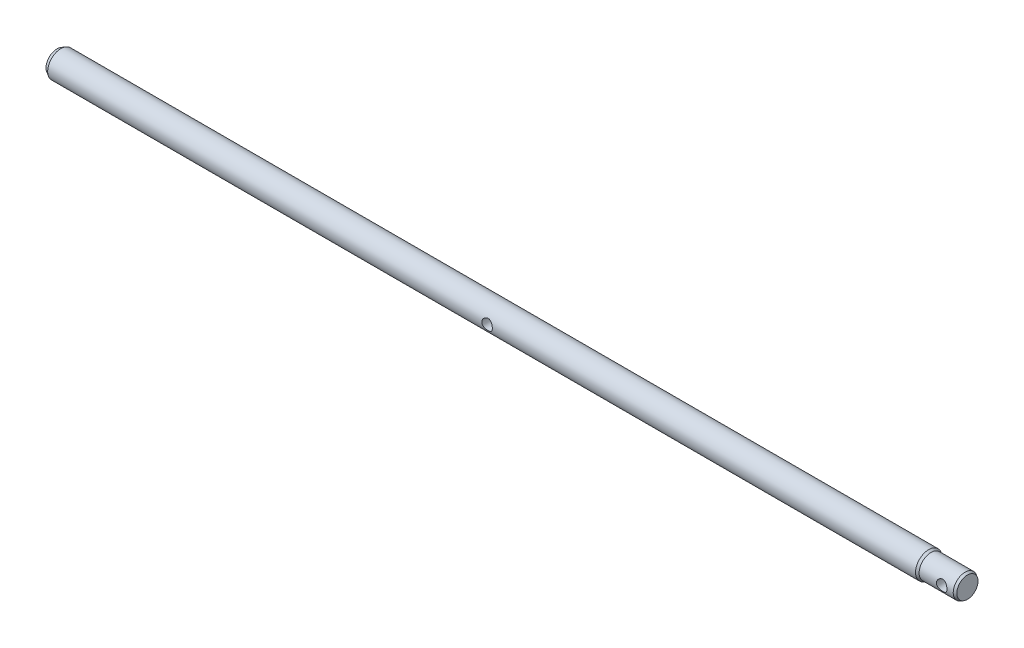
ISO-10303-21;
HEADER;
FILE_DESCRIPTION(('STEP AP214'),'2;1');
FILE_NAME('part.step','',(''),(''),'','','');
FILE_SCHEMA(('AUTOMOTIVE_DESIGN { 1 0 10303 214 1 1 1 1 }'));
ENDSEC;
DATA;
#1=APPLICATION_CONTEXT('core data for automotive mechanical design processes');
#2=APPLICATION_PROTOCOL_DEFINITION('international standard','automotive_design',2000,#1);
#3=PRODUCT_CONTEXT('',#1,'mechanical');
#4=PRODUCT('Part','Part','',(#3));
#5=PRODUCT_RELATED_PRODUCT_CATEGORY('part','',(#4));
#6=PRODUCT_DEFINITION_FORMATION('','',#4);
#7=PRODUCT_DEFINITION_CONTEXT('part definition',#1,'design');
#8=PRODUCT_DEFINITION('design','',#6,#7);
#9=PRODUCT_DEFINITION_SHAPE('','',#8);
#10=(LENGTH_UNIT() NAMED_UNIT(*) SI_UNIT(.MILLI.,.METRE.));
#11=(NAMED_UNIT(*) PLANE_ANGLE_UNIT() SI_UNIT($,.RADIAN.));
#12=(NAMED_UNIT(*) SI_UNIT($,.STERADIAN.) SOLID_ANGLE_UNIT());
#13=UNCERTAINTY_MEASURE_WITH_UNIT(LENGTH_MEASURE(1.E-05),#10,'distance_accuracy_value','');
#14=(GEOMETRIC_REPRESENTATION_CONTEXT(3) GLOBAL_UNCERTAINTY_ASSIGNED_CONTEXT((#13)) GLOBAL_UNIT_ASSIGNED_CONTEXT((#10,
#11,#12)) REPRESENTATION_CONTEXT('',''));
#15=CARTESIAN_POINT('',(0.,0.,0.));
#16=DIRECTION('',(0.,0.,1.));
#17=DIRECTION('',(1.,0.,0.));
#18=AXIS2_PLACEMENT_3D('',#15,#16,#17);
#19=CARTESIAN_POINT('',(-142.,0.,0.));
#20=DIRECTION('',(-1.,0.,0.));
#21=DIRECTION('',(0.,0.,1.));
#22=AXIS2_PLACEMENT_3D('',#19,#20,#21);
#23=PLANE('',#22);
#24=CARTESIAN_POINT('',(-142.,0.,0.));
#25=DIRECTION('',(-1.,0.,0.));
#26=DIRECTION('',(0.,0.,1.));
#27=AXIS2_PLACEMENT_3D('',#24,#25,#26);
#28=CIRCLE('',#27,8.26794919243105);
#29=CARTESIAN_POINT('',(-142.,0.,8.26794919243105));
#30=VERTEX_POINT('',#29);
#31=EDGE_CURVE('E43',#30,#30,#28,.T.);
#32=ORIENTED_EDGE('',*,*,#31,.T.);
#33=EDGE_LOOP('',(#32));
#34=FACE_BOUND('',#33,.T.);
#35=ADVANCED_FACE('F33',(#34),#23,.T.);
#36=CARTESIAN_POINT('',(-98.,0.,0.));
#37=DIRECTION('',(-1.,0.,0.));
#38=DIRECTION('',(0.,0.,1.));
#39=AXIS2_PLACEMENT_3D('',#36,#37,#38);
#40=CYLINDRICAL_SURFACE('',#39,9.99999999999996);
#41=CARTESIAN_POINT('',(197.,0.,9.99999999999996));
#42=CARTESIAN_POINT('',(196.999998425067,0.107549581345533,9.9999988687126));
#43=CARTESIAN_POINT('',(196.99565632892,0.215132147940354,9.99825999367795));
#44=CARTESIAN_POINT('',(196.978326617216,0.429535200549536,9.99134740691104));
#45=CARTESIAN_POINT('',(196.965333546597,0.536355162703287,9.98617152790584));
#46=CARTESIAN_POINT('',(196.930791965449,0.748635856497401,9.97250573560114));
#47=CARTESIAN_POINT('',(196.90922494538,0.854093134440854,9.96400865312139));
#48=CARTESIAN_POINT('',(196.857758269563,1.06266761114008,9.9439301721157));
#49=CARTESIAN_POINT('',(196.827855233745,1.16578384227259,9.93234752254495));
#50=CARTESIAN_POINT('',(196.726277191284,1.46979509681069,9.893491121622));
#51=CARTESIAN_POINT('',(196.642578180994,1.66629107461993,9.8620445884613));
#52=CARTESIAN_POINT('',(196.44595378265,2.04217417878103,9.79113035538704));
#53=CARTESIAN_POINT('',(196.333038539885,2.22156721456799,9.75166544086258));
#54=CARTESIAN_POINT('',(196.075531245478,2.56699339938209,9.66661825353087));
#55=CARTESIAN_POINT('',(195.929787289424,2.73212223266509,9.62084608086595));
#56=CARTESIAN_POINT('',(195.613199390848,3.03635232313264,9.52921139577227));
#57=CARTESIAN_POINT('',(195.442343240983,3.17544084661153,9.48334885017042));
#58=CARTESIAN_POINT('',(195.071144031434,3.42974847409894,9.39445587657954));
#59=CARTESIAN_POINT('',(194.869827073936,3.54362978572888,9.35164233015929));
#60=CARTESIAN_POINT('',(194.448927157199,3.73550961465234,9.27667293288066));
#61=CARTESIAN_POINT('',(194.229352932259,3.81352517485722,9.24451202207141));
#62=CARTESIAN_POINT('',(193.788575344314,3.92779760260541,9.19652715590085));
#63=CARTESIAN_POINT('',(193.567897531912,3.96578791979825,9.1800284077138));
#64=CARTESIAN_POINT('',(193.122730000323,4.00434593508727,9.16328008038138));
#65=CARTESIAN_POINT('',(192.898242209989,4.00493203570085,9.16302251073198));
#66=CARTESIAN_POINT('',(192.468486657777,3.96997873214739,9.17821000534297));
#67=CARTESIAN_POINT('',(192.262968571234,3.93695062778271,9.19256349925662));
#68=CARTESIAN_POINT('',(191.86068088765,3.83989376129507,9.23352375055549));
#69=CARTESIAN_POINT('',(191.663912823694,3.77585958980133,9.26013264599917));
#70=CARTESIAN_POINT('',(191.279964327708,3.61738946491139,9.32318970221157));
#71=CARTESIAN_POINT('',(191.093061521918,3.52235972457939,9.35982758573419));
#72=CARTESIAN_POINT('',(190.73716836725,3.30501292151569,9.43876232767922));
#73=CARTESIAN_POINT('',(190.568184781187,3.1826856102159,9.48106130910407));
#74=CARTESIAN_POINT('',(190.239180542404,2.90310119889356,9.57053473488077));
#75=CARTESIAN_POINT('',(190.08086254111,2.74387492593716,9.61783329953248));
#76=CARTESIAN_POINT('',(189.792631043994,2.40062885486448,9.70919649915611));
#77=CARTESIAN_POINT('',(189.662723205179,2.21660413066996,9.75326048890389));
#78=CARTESIAN_POINT('',(189.432765105169,1.82415530521053,9.83429362529355));
#79=CARTESIAN_POINT('',(189.333355437606,1.61532098269263,9.87110540190895));
#80=CARTESIAN_POINT('',(189.171664277844,1.18204753096604,9.93229656657443));
#81=CARTESIAN_POINT('',(189.109363924885,0.957616393699384,9.95668226924741));
#82=CARTESIAN_POINT('',(189.027103409161,0.513791775215582,9.98912279013834));
#83=CARTESIAN_POINT('',(189.004855091493,0.294886587971133,9.9980589166703));
#84=CARTESIAN_POINT('',(188.996573798943,-0.143690619615711,10.0013695702125));
#85=CARTESIAN_POINT('',(189.010531436905,-0.363362426448185,9.99574787164573));
#86=CARTESIAN_POINT('',(189.072583505104,-0.786865478243657,9.97115134127507));
#87=CARTESIAN_POINT('',(189.119115960703,-0.990964983549767,9.95278782691059));
#88=CARTESIAN_POINT('',(189.242871416619,-1.38827085612275,9.90518882810979));
#89=CARTESIAN_POINT('',(189.320098359335,-1.58147582045412,9.87595194712995));
#90=CARTESIAN_POINT('',(189.505569879362,-1.95815757162884,9.80833189541682));
#91=CARTESIAN_POINT('',(189.614690944095,-2.14115604549353,9.76969631959843));
#92=CARTESIAN_POINT('',(189.859880647803,-2.4868871825104,9.68746729490804));
#93=CARTESIAN_POINT('',(189.995960085814,-2.64961168158685,9.64387186219638));
#94=CARTESIAN_POINT('',(190.301740025933,-2.96144608598878,9.55290235277177));
#95=CARTESIAN_POINT('',(190.473067083141,-3.10894786734725,9.50546882853783));
#96=CARTESIAN_POINT('',(190.83888016589,-3.37350239509233,9.41483345830576));
#97=CARTESIAN_POINT('',(191.033370000199,-3.4905501236659,9.37163231039238));
#98=CARTESIAN_POINT('',(191.442923389673,-3.69161500286276,9.29428599829326));
#99=CARTESIAN_POINT('',(191.658168000243,-3.77530118531765,9.26023261821736));
#100=CARTESIAN_POINT('',(192.101467301613,-3.90459244315907,9.20647346903732));
#101=CARTESIAN_POINT('',(192.329512404842,-3.95022562452796,9.18675711197456));
#102=CARTESIAN_POINT('',(192.774255809844,-3.99943122157416,9.16543518780385));
#103=CARTESIAN_POINT('',(192.990589701895,-4.00579411777209,9.16262842667608));
#104=CARTESIAN_POINT('',(193.421089692721,-3.98360636538273,9.17229671415005));
#105=CARTESIAN_POINT('',(193.635256063282,-3.95506015014709,9.18476982225492));
#106=CARTESIAN_POINT('',(194.04666446089,-3.86614256488128,9.22253300486266));
#107=CARTESIAN_POINT('',(194.244240846221,-3.80707437387706,9.24729672182965));
#108=CARTESIAN_POINT('',(194.62675696179,-3.66001151041637,9.30647993934961));
#109=CARTESIAN_POINT('',(194.811693185111,-3.5720088493455,9.340902106151));
#110=CARTESIAN_POINT('',(195.175220410709,-3.36374310804133,9.41797252826466));
#111=CARTESIAN_POINT('',(195.352841830688,-3.24192140926544,9.46097893410832));
#112=CARTESIAN_POINT('',(195.685982142625,-2.97179350239177,9.54927479921247));
#113=CARTESIAN_POINT('',(195.84149434729,-2.82347931168581,9.59456494363936));
#114=CARTESIAN_POINT('',(196.136423592531,-2.49297412446699,9.6858764714096));
#115=CARTESIAN_POINT('',(196.274143383982,-2.30921017071955,9.73175488236388));
#116=CARTESIAN_POINT('',(196.456048108938,-2.01716584575532,9.79495027625766));
#117=CARTESIAN_POINT('',(196.512607063853,-1.91699501972423,9.81509269692651));
#118=CARTESIAN_POINT('',(196.617037995405,-1.71180110982479,9.85294835133015));
#119=CARTESIAN_POINT('',(196.664913949808,-1.60678027559742,9.87066269647661));
#120=CARTESIAN_POINT('',(196.750747984685,-1.39454646904328,9.90285599354906));
#121=CARTESIAN_POINT('',(196.788870154747,-1.28740777135872,9.91738778532473));
#122=CARTESIAN_POINT('',(196.855921347721,-1.06995577523384,9.94319722915709));
#123=CARTESIAN_POINT('',(196.88485465735,-0.959643983352626,9.95447639837578));
#124=CARTESIAN_POINT('',(196.933174836149,-0.736945215856847,9.97343330649394));
#125=CARTESIAN_POINT('',(196.952585911645,-0.624564263591293,9.98112017494331));
#126=CARTESIAN_POINT('',(196.981738570666,-0.398419132407614,9.99270031578289));
#127=CARTESIAN_POINT('',(196.991487026834,-0.284655994966361,9.99659628445546));
#128=CARTESIAN_POINT('',(196.998785895573,-0.113830463425496,9.99951445883953));
#129=CARTESIAN_POINT('',(197.000000833522,-0.0569198512645321,10.0000005987257));
#130=CARTESIAN_POINT('',(197.,0.,9.99999999999996));
#131=B_SPLINE_CURVE_WITH_KNOTS('',3,(#41,#42,#43,#44,#45,#46,#47,#48,#49,#50,#51,#52,#53,#54,
#55,#56,#57,#58,#59,#60,#61,#62,#63,#64,#65,#66,#67,#68,#69,#70,#71,#72,#73,#74,#75,#76,#77,#78,
#79,#80,#81,#82,#83,#84,#85,#86,#87,#88,#89,#90,#91,#92,#93,#94,#95,#96,#97,#98,#99,#100,#101,
#102,#103,#104,#105,#106,#107,#108,#109,#110,#111,#112,#113,#114,#115,#116,#117,#118,#119,#120,
#121,#122,#123,#124,#125,#126,#127,#128,#129,#130),.UNSPECIFIED.,.T.,.F.,(4,2,2,2,2,2,2,2,2,2,2,
2,2,2,2,2,2,2,2,2,2,2,2,2,2,2,2,2,2,2,2,2,2,2,2,2,2,2,2,2,2,2,2,2,4),(0.,0.322603993422146,
0.645411604786468,0.968919914471222,1.29255959093094,1.93701523385825,2.58124739027476,
3.25313995292302,3.92536021760332,4.62749749529943,5.32930078128044,5.99927442509165,
6.66891844572484,7.29195888698823,7.91510806412267,8.55097484497804,9.18708075776539,
9.87235930273286,10.5577741757964,11.2567305822579,11.9553314412775,12.6125760095619,
13.2696501904034,13.897201430289,14.5248332988777,15.171662586967,15.8187515089811,
16.50856181149,17.1984856998767,17.8950932218182,18.5911857719204,19.2371857868567,
19.8831037702626,20.5034786899771,21.1240250351049,21.7801016801355,22.4363763459696,
23.1352007896784,23.4851924266231,23.8350233218042,24.1785111324565,24.5218384656199,
24.864288449595,25.2064946871485,25.3772305569976),.UNSPECIFIED.);
#132=CARTESIAN_POINT('',(197.,0.,9.99999999999996));
#133=VERTEX_POINT('',#132);
#134=EDGE_CURVE('E36',#133,#133,#131,.T.);
#135=ORIENTED_EDGE('',*,*,#134,.F.);
#136=EDGE_LOOP('',(#135));
#137=FACE_BOUND('',#136,.T.);
#138=CARTESIAN_POINT('',(197.,0.,-9.99999999999996));
#139=CARTESIAN_POINT('',(196.999998425067,-0.107549581345535,-9.9999988687126));
#140=CARTESIAN_POINT('',(196.99565632892,-0.215132147940358,-9.99825999367795));
#141=CARTESIAN_POINT('',(196.978326617216,-0.429535200549543,-9.99134740691104));
#142=CARTESIAN_POINT('',(196.965333546597,-0.536355162703295,-9.98617152790584));
#143=CARTESIAN_POINT('',(196.930791965449,-0.748635856497411,-9.97250573560114));
#144=CARTESIAN_POINT('',(196.90922494538,-0.854093134440865,-9.96400865312139));
#145=CARTESIAN_POINT('',(196.857758269563,-1.06266761114009,-9.9439301721157));
#146=CARTESIAN_POINT('',(196.827855233745,-1.16578384227259,-9.93234752254495));
#147=CARTESIAN_POINT('',(196.726277191284,-1.46979509681069,-9.893491121622));
#148=CARTESIAN_POINT('',(196.642578180994,-1.66629107461993,-9.8620445884613));
#149=CARTESIAN_POINT('',(196.44595378265,-2.04217417878102,-9.79113035538704));
#150=CARTESIAN_POINT('',(196.333038539885,-2.22156721456799,-9.75166544086258));
#151=CARTESIAN_POINT('',(196.075531245478,-2.56699339938209,-9.66661825353087));
#152=CARTESIAN_POINT('',(195.929787289424,-2.73212223266509,-9.62084608086595));
#153=CARTESIAN_POINT('',(195.613199390848,-3.03635232313264,-9.52921139577227));
#154=CARTESIAN_POINT('',(195.442343240983,-3.17544084661153,-9.48334885017042));
#155=CARTESIAN_POINT('',(195.071144031434,-3.42974847409894,-9.39445587657954));
#156=CARTESIAN_POINT('',(194.869827073936,-3.54362978572888,-9.3516423301593));
#157=CARTESIAN_POINT('',(194.448927157199,-3.73550961465234,-9.27667293288066));
#158=CARTESIAN_POINT('',(194.229352932259,-3.81352517485722,-9.24451202207141));
#159=CARTESIAN_POINT('',(193.788575344314,-3.92779760260541,-9.19652715590085));
#160=CARTESIAN_POINT('',(193.567897531912,-3.96578791979825,-9.1800284077138));
#161=CARTESIAN_POINT('',(193.122730000323,-4.00434593508727,-9.16328008038138));
#162=CARTESIAN_POINT('',(192.898242209989,-4.00493203570085,-9.16302251073198));
#163=CARTESIAN_POINT('',(192.468486657777,-3.96997873214739,-9.17821000534297));
#164=CARTESIAN_POINT('',(192.262968571234,-3.93695062778271,-9.19256349925662));
#165=CARTESIAN_POINT('',(191.86068088765,-3.83989376129507,-9.23352375055549));
#166=CARTESIAN_POINT('',(191.663912823694,-3.77585958980133,-9.26013264599917));
#167=CARTESIAN_POINT('',(191.279964327708,-3.61738946491139,-9.32318970221157));
#168=CARTESIAN_POINT('',(191.093061521918,-3.52235972457939,-9.35982758573419));
#169=CARTESIAN_POINT('',(190.73716836725,-3.30501292151569,-9.43876232767922));
#170=CARTESIAN_POINT('',(190.568184781187,-3.1826856102159,-9.48106130910407));
#171=CARTESIAN_POINT('',(190.239180542404,-2.90310119889356,-9.57053473488077));
#172=CARTESIAN_POINT('',(190.08086254111,-2.74387492593716,-9.61783329953248));
#173=CARTESIAN_POINT('',(189.792631043994,-2.40062885486448,-9.70919649915611));
#174=CARTESIAN_POINT('',(189.662723205179,-2.21660413066996,-9.75326048890389));
#175=CARTESIAN_POINT('',(189.432765105169,-1.82415530521053,-9.83429362529355));
#176=CARTESIAN_POINT('',(189.333355437606,-1.61532098269263,-9.87110540190895));
#177=CARTESIAN_POINT('',(189.171664277844,-1.18204753096604,-9.93229656657443));
#178=CARTESIAN_POINT('',(189.109363924885,-0.957616393699384,-9.95668226924741));
#179=CARTESIAN_POINT('',(189.027103409161,-0.513791775215582,-9.98912279013834));
#180=CARTESIAN_POINT('',(189.004855091493,-0.294886587971133,-9.9980589166703));
#181=CARTESIAN_POINT('',(188.996573798943,0.143690619615711,-10.0013695702125));
#182=CARTESIAN_POINT('',(189.010531436905,0.363362426448185,-9.99574787164573));
#183=CARTESIAN_POINT('',(189.072583505104,0.786865478243657,-9.97115134127507));
#184=CARTESIAN_POINT('',(189.119115960703,0.990964983549767,-9.95278782691059));
#185=CARTESIAN_POINT('',(189.242871416619,1.38827085612275,-9.90518882810979));
#186=CARTESIAN_POINT('',(189.320098359335,1.58147582045412,-9.87595194712995));
#187=CARTESIAN_POINT('',(189.505569879362,1.95815757162884,-9.80833189541682));
#188=CARTESIAN_POINT('',(189.614690944095,2.14115604549353,-9.76969631959843));
#189=CARTESIAN_POINT('',(189.859880647803,2.4868871825104,-9.68746729490804));
#190=CARTESIAN_POINT('',(189.995960085814,2.64961168158685,-9.64387186219638));
#191=CARTESIAN_POINT('',(190.301740025933,2.96144608598878,-9.55290235277177));
#192=CARTESIAN_POINT('',(190.473067083141,3.10894786734724,-9.50546882853783));
#193=CARTESIAN_POINT('',(190.83888016589,3.37350239509233,-9.41483345830576));
#194=CARTESIAN_POINT('',(191.033370000199,3.49055012366589,-9.37163231039238));
#195=CARTESIAN_POINT('',(191.442923389673,3.69161500286276,-9.29428599829326));
#196=CARTESIAN_POINT('',(191.658168000243,3.77530118531765,-9.26023261821736));
#197=CARTESIAN_POINT('',(192.101467301613,3.90459244315907,-9.20647346903732));
#198=CARTESIAN_POINT('',(192.329512404842,3.95022562452796,-9.18675711197456));
#199=CARTESIAN_POINT('',(192.774255809844,3.99943122157416,-9.16543518780385));
#200=CARTESIAN_POINT('',(192.990589701895,4.00579411777209,-9.16262842667608));
#201=CARTESIAN_POINT('',(193.421089692721,3.98360636538273,-9.17229671415005));
#202=CARTESIAN_POINT('',(193.635256063282,3.95506015014709,-9.18476982225492));
#203=CARTESIAN_POINT('',(194.04666446089,3.86614256488128,-9.22253300486266));
#204=CARTESIAN_POINT('',(194.244240846221,3.80707437387706,-9.24729672182965));
#205=CARTESIAN_POINT('',(194.62675696179,3.66001151041637,-9.30647993934961));
#206=CARTESIAN_POINT('',(194.811693185111,3.5720088493455,-9.340902106151));
#207=CARTESIAN_POINT('',(195.175220410709,3.36374310804133,-9.41797252826466));
#208=CARTESIAN_POINT('',(195.352841830688,3.24192140926544,-9.46097893410832));
#209=CARTESIAN_POINT('',(195.685982142625,2.97179350239177,-9.54927479921247));
#210=CARTESIAN_POINT('',(195.84149434729,2.82347931168581,-9.59456494363936));
#211=CARTESIAN_POINT('',(196.136423592531,2.49297412446699,-9.6858764714096));
#212=CARTESIAN_POINT('',(196.274143383982,2.30921017071955,-9.73175488236389));
#213=CARTESIAN_POINT('',(196.456048108938,2.01716584575533,-9.79495027625766));
#214=CARTESIAN_POINT('',(196.512607063853,1.91699501972425,-9.81509269692651));
#215=CARTESIAN_POINT('',(196.617037995405,1.7118011098248,-9.85294835133015));
#216=CARTESIAN_POINT('',(196.664913949808,1.60678027559742,-9.87066269647661));
#217=CARTESIAN_POINT('',(196.750747984685,1.39454646904328,-9.90285599354906));
#218=CARTESIAN_POINT('',(196.788870154747,1.28740777135872,-9.91738778532473));
#219=CARTESIAN_POINT('',(196.855921347721,1.06995577523384,-9.94319722915709));
#220=CARTESIAN_POINT('',(196.88485465735,0.959643983352623,-9.95447639837578));
#221=CARTESIAN_POINT('',(196.933174836149,0.736945215856843,-9.97343330649394));
#222=CARTESIAN_POINT('',(196.952585911645,0.62456426359129,-9.98112017494331));
#223=CARTESIAN_POINT('',(196.981738570666,0.398419132407612,-9.99270031578289));
#224=CARTESIAN_POINT('',(196.991487026834,0.28465599496636,-9.99659628445546));
#225=CARTESIAN_POINT('',(196.998785895573,0.113830463425497,-9.99951445883953));
#226=CARTESIAN_POINT('',(197.000000833522,0.0569198512645322,-10.0000005987257));
#227=CARTESIAN_POINT('',(197.,0.,-9.99999999999996));
#228=B_SPLINE_CURVE_WITH_KNOTS('',3,(#138,#139,#140,#141,#142,#143,#144,#145,#146,#147,#148,
#149,#150,#151,#152,#153,#154,#155,#156,#157,#158,#159,#160,#161,#162,#163,#164,#165,#166,#167,
#168,#169,#170,#171,#172,#173,#174,#175,#176,#177,#178,#179,#180,#181,#182,#183,#184,#185,#186,
#187,#188,#189,#190,#191,#192,#193,#194,#195,#196,#197,#198,#199,#200,#201,#202,#203,#204,#205,
#206,#207,#208,#209,#210,#211,#212,#213,#214,#215,#216,#217,#218,#219,#220,#221,#222,#223,#224,
#225,#226,#227),.UNSPECIFIED.,.T.,.F.,(4,2,2,2,2,2,2,2,2,2,2,2,2,2,2,2,2,2,2,2,2,2,2,2,2,2,2,2,
2,2,2,2,2,2,2,2,2,2,2,2,2,2,2,2,4),(0.,0.322603993422152,0.645411604786476,0.968919914471232,
1.29255959093094,1.93701523385824,2.58124739027476,3.25313995292302,3.92536021760332,
4.62749749529943,5.32930078128044,5.99927442509165,6.66891844572484,7.29195888698823,
7.91510806412267,8.55097484497804,9.18708075776539,9.87235930273286,10.5577741757964,
11.2567305822579,11.9553314412775,12.6125760095619,13.2696501904034,13.897201430289,
14.5248332988777,15.171662586967,15.8187515089811,16.50856181149,17.1984856998767,
17.8950932218182,18.5911857719204,19.2371857868567,19.8831037702626,20.5034786899771,
21.1240250351049,21.7801016801355,22.4363763459696,23.1352007896784,23.4851924266231,
23.8350233218042,24.1785111324565,24.52183846562,24.864288449595,25.2064946871485,
25.3772305569976),.UNSPECIFIED.);
#229=CARTESIAN_POINT('',(197.,0.,-9.99999999999996));
#230=VERTEX_POINT('',#229);
#231=EDGE_CURVE('E107',#230,#230,#228,.T.);
#232=ORIENTED_EDGE('',*,*,#231,.F.);
#233=EDGE_LOOP('',(#232));
#234=FACE_BOUND('',#233,.T.);
#235=CARTESIAN_POINT('',(-139.,0.,0.));
#236=DIRECTION('',(-1.,0.,0.));
#237=DIRECTION('',(0.,0.,1.));
#238=AXIS2_PLACEMENT_3D('',#235,#236,#237);
#239=CIRCLE('',#238,9.99999999999996);
#240=CARTESIAN_POINT('',(-139.,0.,9.99999999999996));
#241=VERTEX_POINT('',#240);
#242=EDGE_CURVE('E10',#241,#241,#239,.F.);
#243=ORIENTED_EDGE('',*,*,#242,.T.);
#244=EDGE_LOOP('',(#243));
#245=FACE_BOUND('',#244,.T.);
#246=CARTESIAN_POINT('',(516.767949192431,0.,0.));
#247=DIRECTION('',(1.,0.,0.));
#248=DIRECTION('',(0.,0.,-1.));
#249=AXIS2_PLACEMENT_3D('',#246,#247,#248);
#250=CIRCLE('',#249,9.99999999999996);
#251=CARTESIAN_POINT('',(516.767949192431,0.,-9.99999999999996));
#252=VERTEX_POINT('',#251);
#253=EDGE_CURVE('E48',#252,#252,#250,.F.);
#254=ORIENTED_EDGE('',*,*,#253,.T.);
#255=EDGE_LOOP('',(#254));
#256=FACE_BOUND('',#255,.T.);
#257=ADVANCED_FACE('F90',(#137,#234,#245,#256),#40,.T.);
#258=CARTESIAN_POINT('',(-98.,0.,0.));
#259=DIRECTION('',(-1.,0.,0.));
#260=DIRECTION('',(0.,0.,1.));
#261=AXIS2_PLACEMENT_3D('',#258,#259,#260);
#262=CYLINDRICAL_SURFACE('',#261,9.);
#263=CARTESIAN_POINT('',(539.5,0.,9.));
#264=CARTESIAN_POINT('',(539.499999163301,0.106543560764117,8.99999931236002));
#265=CARTESIAN_POINT('',(539.495737372374,0.213114535933692,8.99810295733528));
#266=CARTESIAN_POINT('',(539.478733589349,0.425487759472882,8.99056534028924));
#267=CARTESIAN_POINT('',(539.465986753178,0.531289533809611,8.9849219391011));
#268=CARTESIAN_POINT('',(539.432115107433,0.741497571680322,8.97002203225641));
#269=CARTESIAN_POINT('',(539.410974631947,0.845900846236384,8.96075877099567));
#270=CARTESIAN_POINT('',(539.360547282036,1.05237393818871,8.93886560682324));
#271=CARTESIAN_POINT('',(539.331257077342,1.15444278316295,8.92623432770846));
#272=CARTESIAN_POINT('',(539.231826836376,1.45528706477072,8.88385509084484));
#273=CARTESIAN_POINT('',(539.149964533879,1.64969223818532,8.84954694128078));
#274=CARTESIAN_POINT('',(538.957842670196,2.02169397176,8.77205693690158));
#275=CARTESIAN_POINT('',(538.84758958203,2.19929435076139,8.72887710525827));
#276=CARTESIAN_POINT('',(538.595329590415,2.54295194306071,8.63520005099135));
#277=CARTESIAN_POINT('',(538.451994251306,2.70796463469608,8.58444255570289));
#278=CARTESIAN_POINT('',(538.140513942142,3.01251193717394,8.48237167141421));
#279=CARTESIAN_POINT('',(537.972354290521,3.15203136079605,8.43105797021838));
#280=CARTESIAN_POINT('',(537.60407902268,3.40970641309575,8.33031613694452));
#281=CARTESIAN_POINT('',(537.402678923526,3.5261634282701,8.28116793674047));
#282=CARTESIAN_POINT('',(537.08644164882,3.67379855799918,8.21620901778823));
#283=CARTESIAN_POINT('',(536.978630422092,3.7185134302312,8.19601074422209));
#284=CARTESIAN_POINT('',(536.758980884334,3.79849956446535,8.15924882688403));
#285=CARTESIAN_POINT('',(536.647144776258,3.83377590592704,8.14268322901323));
#286=CARTESIAN_POINT('',(536.426209995224,3.89288163397949,8.11458487568386));
#287=CARTESIAN_POINT('',(536.3172725733,3.91721191584562,8.1028347628908));
#288=CARTESIAN_POINT('',(536.09742166204,3.95670961203996,8.08362129694744));
#289=CARTESIAN_POINT('',(535.986509151194,3.97188144036288,8.07615587883755));
#290=CARTESIAN_POINT('',(535.763627755177,3.9928718278227,8.06579894008708));
#291=CARTESIAN_POINT('',(535.651659252593,3.99869365272532,8.06290582244073));
#292=CARTESIAN_POINT('',(535.427610878713,4.00091360303008,8.06180452405908));
#293=CARTESIAN_POINT('',(535.315531015033,3.99731233389617,8.06359604232091));
#294=CARTESIAN_POINT('',(535.102272819528,3.98148137626881,8.07142338434779));
#295=CARTESIAN_POINT('',(535.001019537866,3.97005575276387,8.07706352800998));
#296=CARTESIAN_POINT('',(534.799928930826,3.93957606138947,8.09197245318638));
#297=CARTESIAN_POINT('',(534.700092073828,3.92051952834522,8.1012424072939));
#298=CARTESIAN_POINT('',(534.403762370701,3.85217674750056,8.13408651281412));
#299=CARTESIAN_POINT('',(534.210282121967,3.79170447177772,8.16270181226472));
#300=CARTESIAN_POINT('',(533.832101510314,3.64150006667491,8.23081734439646));
#301=CARTESIAN_POINT('',(533.647695712948,3.55114161901361,8.2705474900895));
#302=CARTESIAN_POINT('',(533.295856571362,3.34416344596325,8.35638151227701));
#303=CARTESIAN_POINT('',(533.12843041628,3.22753266369897,8.40248806916055));
#304=CARTESIAN_POINT('',(532.798170220577,2.95801583387873,8.50133279495594));
#305=CARTESIAN_POINT('',(532.637372351981,2.80270476501178,8.55427944513662));
#306=CARTESIAN_POINT('',(532.343365804279,2.46687651443059,8.65709798777378));
#307=CARTESIAN_POINT('',(532.210165466047,2.28635173983005,8.70696894746715));
#308=CARTESIAN_POINT('',(531.971573351037,1.89830549192185,8.79984898075653));
#309=CARTESIAN_POINT('',(531.867119260949,1.69014406889664,8.84261183911195));
#310=CARTESIAN_POINT('',(531.695446152807,1.25681485203022,8.91451161297058));
#311=CARTESIAN_POINT('',(531.628203660739,1.03165788152718,8.94365711683337));
#312=CARTESIAN_POINT('',(531.537376218645,0.587641070885746,8.98336516942802));
#313=CARTESIAN_POINT('',(531.511066589329,0.369442331131799,8.99508492412832));
#314=CARTESIAN_POINT('',(531.494593770026,-0.0685540826286881,9.00240007523685));
#315=CARTESIAN_POINT('',(531.504418302402,-0.288351188214406,8.9980009485081));
#316=CARTESIAN_POINT('',(531.558087099518,-0.709814814369052,8.97430591809511));
#317=CARTESIAN_POINT('',(531.599921621331,-0.911792765731219,8.95589038121198));
#318=CARTESIAN_POINT('',(531.713516121934,-1.30558421565958,8.90701082021955));
#319=CARTESIAN_POINT('',(531.785279737623,-1.49739647572635,8.87654533185794));
#320=CARTESIAN_POINT('',(531.95897713672,-1.87220783588446,8.80524764691281));
#321=CARTESIAN_POINT('',(532.06178231674,-2.05474529218526,8.76412168349641));
#322=CARTESIAN_POINT('',(532.293705230562,-2.40063957243043,8.675762081931));
#323=CARTESIAN_POINT('',(532.422834423821,-2.5639879939583,8.62852578709612));
#324=CARTESIAN_POINT('',(532.715823955775,-2.88073032703294,8.5282573937559));
#325=CARTESIAN_POINT('',(532.881644688997,-3.03226090719452,8.4750650088176));
#326=CARTESIAN_POINT('',(533.237147879754,-3.30602071854252,8.37207677010345));
#327=CARTESIAN_POINT('',(533.426838760586,-3.42823956174358,8.32228212493561));
#328=CARTESIAN_POINT('',(533.728245445123,-3.5880743416448,8.2540407521636));
#329=CARTESIAN_POINT('',(533.832879732932,-3.63788387634672,8.23214803707208));
#330=CARTESIAN_POINT('',(534.046588929641,-3.72840991291048,8.19154569522209));
#331=CARTESIAN_POINT('',(534.155661818436,-3.76913049781948,8.17283464006354));
#332=CARTESIAN_POINT('',(534.377421735722,-3.84101557494809,8.13929816800194));
#333=CARTESIAN_POINT('',(534.490106629092,-3.87218560166711,8.1244705014215));
#334=CARTESIAN_POINT('',(534.718249041558,-3.92460929100955,8.09927719768152));
#335=CARTESIAN_POINT('',(534.83370624585,-3.94586407399637,8.08891105640649));
#336=CARTESIAN_POINT('',(535.056479353329,-3.97678770171059,8.07374935284));
#337=CARTESIAN_POINT('',(535.163653419527,-3.9872875557506,8.06855529639578));
#338=CARTESIAN_POINT('',(535.37865985614,-3.9996093926038,8.06245450280349));
#339=CARTESIAN_POINT('',(535.486492433854,-4.00142848498409,8.06154919368018));
#340=CARTESIAN_POINT('',(535.701844073469,-3.99635429337704,8.06406616285806));
#341=CARTESIAN_POINT('',(535.809363280781,-3.98946605490684,8.06748593496455));
#342=CARTESIAN_POINT('',(536.023297658455,-3.96708318300727,8.07851431964463));
#343=CARTESIAN_POINT('',(536.129712397791,-3.95158530941065,8.08612450923877));
#344=CARTESIAN_POINT('',(536.433253347648,-3.89481025673451,8.11370655018845));
#345=CARTESIAN_POINT('',(536.628043939226,-3.84284512159465,8.13866591875023));
#346=CARTESIAN_POINT('',(537.005998947096,-3.71108221021499,8.19957700487954));
#347=CARTESIAN_POINT('',(537.189159984126,-3.63127638750922,8.23553189998354));
#348=CARTESIAN_POINT('',(537.551664709865,-3.44024324515822,8.31722161393652));
#349=CARTESIAN_POINT('',(537.730011678918,-3.32733013865018,8.36343549057001));
#350=CARTESIAN_POINT('',(538.066253248845,-3.07546946565535,8.45929191031222));
#351=CARTESIAN_POINT('',(538.224139260429,-2.93651102511203,8.50893588001618));
#352=CARTESIAN_POINT('',(538.529240502454,-2.62217220790802,8.61126362572534));
#353=CARTESIAN_POINT('',(538.674314157391,-2.44466910724624,8.66383343564896));
#354=CARTESIAN_POINT('',(538.932884209014,-2.06586629934034,8.76186799200867));
#355=CARTESIAN_POINT('',(539.046366180379,-1.86455578079003,8.80732948852385));
#356=CARTESIAN_POINT('',(539.189219545488,-1.55009155680931,8.86614466582395));
#357=CARTESIAN_POINT('',(539.232125172321,-1.44376115568196,8.88411858212817));
#358=CARTESIAN_POINT('',(539.308773932201,-1.22735110682478,8.91658812616538));
#359=CARTESIAN_POINT('',(539.342521476019,-1.11727329280028,8.93108542793377));
#360=CARTESIAN_POINT('',(539.400402314391,-0.894475004716119,8.95614098674218));
#361=CARTESIAN_POINT('',(539.424558583843,-0.781761539000832,8.96670865291079));
#362=CARTESIAN_POINT('',(539.463066738799,-0.554414643007781,8.9836293170273));
#363=CARTESIAN_POINT('',(539.477425435758,-0.439782603478127,8.98998524296698));
#364=CARTESIAN_POINT('',(539.49119614917,-0.270722867755139,8.99608997508148));
#365=CARTESIAN_POINT('',(539.494496278881,-0.21664466049599,8.99755504734627));
#366=CARTESIAN_POINT('',(539.498898429857,-0.10838000060134,8.99951024035253));
#367=CARTESIAN_POINT('',(539.500000425588,-0.0541935467157973,9.00000034976913));
#368=CARTESIAN_POINT('',(539.5,0.,9.));
#369=B_SPLINE_CURVE_WITH_KNOTS('',3,(#263,#264,#265,#266,#267,#268,#269,#270,#271,#272,#273,
#274,#275,#276,#277,#278,#279,#280,#281,#282,#283,#284,#285,#286,#287,#288,#289,#290,#291,#292,
#293,#294,#295,#296,#297,#298,#299,#300,#301,#302,#303,#304,#305,#306,#307,#308,#309,#310,#311,
#312,#313,#314,#315,#316,#317,#318,#319,#320,#321,#322,#323,#324,#325,#326,#327,#328,#329,#330,
#331,#332,#333,#334,#335,#336,#337,#338,#339,#340,#341,#342,#343,#344,#345,#346,#347,#348,#349,
#350,#351,#352,#353,#354,#355,#356,#357,#358,#359,#360,#361,#362,#363,#364,#365,#366,#367,#368),
.UNSPECIFIED.,.T.,.F.,(4,2,2,2,2,2,2,2,2,2,2,2,2,2,2,2,2,2,2,2,2,2,2,2,2,2,2,2,2,2,2,2,2,2,2,2,
2,2,2,2,2,2,2,2,2,2,2,2,2,2,2,2,4),(0.,0.319575995494495,0.639334592113713,0.959692813851972,
1.28018213803928,1.91817504615683,2.55602262225849,3.22626867716017,3.8969127281578,
4.6062783907759,4.96122462740459,5.31597945944829,5.65223953951955,5.9883374265178,
6.32431789582027,6.66027677783177,6.96605959233552,7.27194127015281,7.88320420131177,
8.5081879760033,9.1334352720527,9.819591204587,10.5059542142737,11.2125921876432,
11.9187838863229,12.5755805291254,13.2321540266912,13.8505799936733,14.4690811319117,
15.1068781804635,15.7449534721389,16.4344546029635,17.1241997308766,17.4776093864016,
17.8308599580232,18.1839054338952,18.5369110080658,18.8599212751302,19.1830390874108,
19.5059697528592,19.8290220330895,20.4355356034,21.0422246126088,21.6877902452576,
22.3336260075753,23.035956671455,23.7386075078664,24.0863996614846,24.4340240108547,
24.7808105646471,25.1273557796158,25.2899067151076,25.4524595387308),.UNSPECIFIED.);
#370=CARTESIAN_POINT('',(539.5,0.,9.));
#371=VERTEX_POINT('',#370);
#372=EDGE_CURVE('E59',#371,#371,#369,.T.);
#373=ORIENTED_EDGE('',*,*,#372,.F.);
#374=EDGE_LOOP('',(#373));
#375=FACE_BOUND('',#374,.T.);
#376=CARTESIAN_POINT('',(539.5,0.,-9.));
#377=CARTESIAN_POINT('',(539.499999163301,-0.106543560764117,-8.99999931236002));
#378=CARTESIAN_POINT('',(539.495737372374,-0.213114535933692,-8.99810295733528));
#379=CARTESIAN_POINT('',(539.478733589349,-0.425487759472882,-8.99056534028924));
#380=CARTESIAN_POINT('',(539.465986753178,-0.531289533809611,-8.9849219391011));
#381=CARTESIAN_POINT('',(539.432115107433,-0.741497571680322,-8.97002203225641));
#382=CARTESIAN_POINT('',(539.410974631947,-0.845900846236384,-8.96075877099567));
#383=CARTESIAN_POINT('',(539.360547282036,-1.05237393818871,-8.93886560682324));
#384=CARTESIAN_POINT('',(539.331257077342,-1.15444278316295,-8.92623432770846));
#385=CARTESIAN_POINT('',(539.231826836376,-1.45528706477072,-8.88385509084484));
#386=CARTESIAN_POINT('',(539.149964533879,-1.64969223818532,-8.84954694128078));
#387=CARTESIAN_POINT('',(538.957842670196,-2.02169397176,-8.77205693690158));
#388=CARTESIAN_POINT('',(538.84758958203,-2.19929435076139,-8.72887710525827));
#389=CARTESIAN_POINT('',(538.595329590415,-2.54295194306071,-8.63520005099135));
#390=CARTESIAN_POINT('',(538.451994251306,-2.70796463469608,-8.58444255570289));
#391=CARTESIAN_POINT('',(538.140513942142,-3.01251193717394,-8.48237167141421));
#392=CARTESIAN_POINT('',(537.972354290521,-3.15203136079605,-8.43105797021838));
#393=CARTESIAN_POINT('',(537.60407902268,-3.40970641309575,-8.33031613694452));
#394=CARTESIAN_POINT('',(537.402678923526,-3.5261634282701,-8.28116793674047));
#395=CARTESIAN_POINT('',(537.08644164882,-3.67379855799918,-8.21620901778823));
#396=CARTESIAN_POINT('',(536.978630422092,-3.7185134302312,-8.19601074422209));
#397=CARTESIAN_POINT('',(536.758980884334,-3.79849956446535,-8.15924882688403));
#398=CARTESIAN_POINT('',(536.647144776258,-3.83377590592704,-8.14268322901323));
#399=CARTESIAN_POINT('',(536.426209995224,-3.89288163397949,-8.11458487568386));
#400=CARTESIAN_POINT('',(536.3172725733,-3.91721191584562,-8.1028347628908));
#401=CARTESIAN_POINT('',(536.09742166204,-3.95670961203996,-8.08362129694744));
#402=CARTESIAN_POINT('',(535.986509151194,-3.97188144036288,-8.07615587883755));
#403=CARTESIAN_POINT('',(535.763627755177,-3.9928718278227,-8.06579894008708));
#404=CARTESIAN_POINT('',(535.651659252593,-3.99869365272532,-8.06290582244073));
#405=CARTESIAN_POINT('',(535.427610878713,-4.00091360303008,-8.06180452405908));
#406=CARTESIAN_POINT('',(535.315531015033,-3.99731233389617,-8.06359604232091));
#407=CARTESIAN_POINT('',(535.102272819528,-3.98148137626881,-8.07142338434779));
#408=CARTESIAN_POINT('',(535.001019537866,-3.97005575276387,-8.07706352800998));
#409=CARTESIAN_POINT('',(534.799928930826,-3.93957606138947,-8.09197245318638));
#410=CARTESIAN_POINT('',(534.700092073828,-3.92051952834522,-8.1012424072939));
#411=CARTESIAN_POINT('',(534.403762370701,-3.85217674750056,-8.13408651281412));
#412=CARTESIAN_POINT('',(534.210282121967,-3.79170447177772,-8.16270181226472));
#413=CARTESIAN_POINT('',(533.832101510314,-3.64150006667491,-8.23081734439646));
#414=CARTESIAN_POINT('',(533.647695712948,-3.55114161901361,-8.2705474900895));
#415=CARTESIAN_POINT('',(533.295856571362,-3.34416344596325,-8.35638151227701));
#416=CARTESIAN_POINT('',(533.12843041628,-3.22753266369897,-8.40248806916055));
#417=CARTESIAN_POINT('',(532.798170220577,-2.95801583387873,-8.50133279495594));
#418=CARTESIAN_POINT('',(532.637372351981,-2.80270476501178,-8.55427944513662));
#419=CARTESIAN_POINT('',(532.343365804279,-2.46687651443059,-8.65709798777378));
#420=CARTESIAN_POINT('',(532.210165466047,-2.28635173983005,-8.70696894746715));
#421=CARTESIAN_POINT('',(531.971573351037,-1.89830549192185,-8.79984898075653));
#422=CARTESIAN_POINT('',(531.867119260949,-1.69014406889664,-8.84261183911195));
#423=CARTESIAN_POINT('',(531.695446152807,-1.25681485203022,-8.91451161297058));
#424=CARTESIAN_POINT('',(531.628203660739,-1.03165788152718,-8.94365711683337));
#425=CARTESIAN_POINT('',(531.537376218645,-0.587641070885746,-8.98336516942802));
#426=CARTESIAN_POINT('',(531.511066589329,-0.369442331131799,-8.99508492412832));
#427=CARTESIAN_POINT('',(531.494593770026,0.0685540826286881,-9.00240007523685));
#428=CARTESIAN_POINT('',(531.504418302402,0.288351188214406,-8.9980009485081));
#429=CARTESIAN_POINT('',(531.558087099518,0.709814814369052,-8.97430591809511));
#430=CARTESIAN_POINT('',(531.599921621331,0.911792765731219,-8.95589038121198));
#431=CARTESIAN_POINT('',(531.713516121934,1.30558421565958,-8.90701082021955));
#432=CARTESIAN_POINT('',(531.785279737623,1.49739647572635,-8.87654533185794));
#433=CARTESIAN_POINT('',(531.95897713672,1.87220783588446,-8.80524764691281));
#434=CARTESIAN_POINT('',(532.06178231674,2.05474529218526,-8.76412168349641));
#435=CARTESIAN_POINT('',(532.293705230562,2.40063957243043,-8.675762081931));
#436=CARTESIAN_POINT('',(532.422834423821,2.5639879939583,-8.62852578709612));
#437=CARTESIAN_POINT('',(532.715823955775,2.88073032703294,-8.5282573937559));
#438=CARTESIAN_POINT('',(532.881644688997,3.03226090719452,-8.4750650088176));
#439=CARTESIAN_POINT('',(533.237147879754,3.30602071854252,-8.37207677010345));
#440=CARTESIAN_POINT('',(533.426838760586,3.42823956174358,-8.32228212493561));
#441=CARTESIAN_POINT('',(533.728245445123,3.5880743416448,-8.2540407521636));
#442=CARTESIAN_POINT('',(533.832879732932,3.63788387634672,-8.23214803707208));
#443=CARTESIAN_POINT('',(534.046588929641,3.72840991291048,-8.19154569522209));
#444=CARTESIAN_POINT('',(534.155661818436,3.76913049781948,-8.17283464006354));
#445=CARTESIAN_POINT('',(534.377421735722,3.84101557494809,-8.13929816800194));
#446=CARTESIAN_POINT('',(534.490106629092,3.87218560166711,-8.1244705014215));
#447=CARTESIAN_POINT('',(534.718249041558,3.92460929100955,-8.09927719768152));
#448=CARTESIAN_POINT('',(534.83370624585,3.94586407399637,-8.08891105640649));
#449=CARTESIAN_POINT('',(535.056479353329,3.97678770171059,-8.07374935284));
#450=CARTESIAN_POINT('',(535.163653419527,3.9872875557506,-8.06855529639578));
#451=CARTESIAN_POINT('',(535.37865985614,3.9996093926038,-8.06245450280349));
#452=CARTESIAN_POINT('',(535.486492433854,4.00142848498409,-8.06154919368018));
#453=CARTESIAN_POINT('',(535.701844073469,3.99635429337704,-8.06406616285806));
#454=CARTESIAN_POINT('',(535.809363280781,3.98946605490684,-8.06748593496455));
#455=CARTESIAN_POINT('',(536.023297658455,3.96708318300727,-8.07851431964463));
#456=CARTESIAN_POINT('',(536.129712397791,3.95158530941065,-8.08612450923877));
#457=CARTESIAN_POINT('',(536.433253347648,3.89481025673451,-8.11370655018845));
#458=CARTESIAN_POINT('',(536.628043939226,3.84284512159465,-8.13866591875023));
#459=CARTESIAN_POINT('',(537.005998947096,3.71108221021499,-8.19957700487954));
#460=CARTESIAN_POINT('',(537.189159984126,3.63127638750922,-8.23553189998354));
#461=CARTESIAN_POINT('',(537.551664709865,3.44024324515822,-8.31722161393652));
#462=CARTESIAN_POINT('',(537.730011678918,3.32733013865018,-8.36343549057001));
#463=CARTESIAN_POINT('',(538.066253248845,3.07546946565535,-8.45929191031222));
#464=CARTESIAN_POINT('',(538.224139260429,2.93651102511203,-8.50893588001618));
#465=CARTESIAN_POINT('',(538.529240502454,2.62217220790802,-8.61126362572534));
#466=CARTESIAN_POINT('',(538.674314157391,2.44466910724624,-8.66383343564896));
#467=CARTESIAN_POINT('',(538.932884209014,2.06586629934034,-8.76186799200867));
#468=CARTESIAN_POINT('',(539.046366180379,1.86455578079003,-8.80732948852385));
#469=CARTESIAN_POINT('',(539.189219545488,1.55009155680931,-8.86614466582395));
#470=CARTESIAN_POINT('',(539.232125172321,1.44376115568196,-8.88411858212817));
#471=CARTESIAN_POINT('',(539.308773932201,1.22735110682478,-8.91658812616538));
#472=CARTESIAN_POINT('',(539.342521476019,1.11727329280028,-8.93108542793377));
#473=CARTESIAN_POINT('',(539.400402314391,0.894475004716119,-8.95614098674218));
#474=CARTESIAN_POINT('',(539.424558583843,0.781761539000832,-8.96670865291079));
#475=CARTESIAN_POINT('',(539.463066738799,0.554414643007781,-8.9836293170273));
#476=CARTESIAN_POINT('',(539.477425435758,0.439782603478127,-8.98998524296698));
#477=CARTESIAN_POINT('',(539.49119614917,0.270722867755139,-8.99608997508148));
#478=CARTESIAN_POINT('',(539.494496278881,0.21664466049599,-8.99755504734627));
#479=CARTESIAN_POINT('',(539.498898429857,0.10838000060134,-8.99951024035253));
#480=CARTESIAN_POINT('',(539.500000425588,0.0541935467157973,-9.00000034976913));
#481=CARTESIAN_POINT('',(539.5,0.,-9.));
#482=B_SPLINE_CURVE_WITH_KNOTS('',3,(#376,#377,#378,#379,#380,#381,#382,#383,#384,#385,#386,
#387,#388,#389,#390,#391,#392,#393,#394,#395,#396,#397,#398,#399,#400,#401,#402,#403,#404,#405,
#406,#407,#408,#409,#410,#411,#412,#413,#414,#415,#416,#417,#418,#419,#420,#421,#422,#423,#424,
#425,#426,#427,#428,#429,#430,#431,#432,#433,#434,#435,#436,#437,#438,#439,#440,#441,#442,#443,
#444,#445,#446,#447,#448,#449,#450,#451,#452,#453,#454,#455,#456,#457,#458,#459,#460,#461,#462,
#463,#464,#465,#466,#467,#468,#469,#470,#471,#472,#473,#474,#475,#476,#477,#478,#479,#480,#481),
.UNSPECIFIED.,.T.,.F.,(4,2,2,2,2,2,2,2,2,2,2,2,2,2,2,2,2,2,2,2,2,2,2,2,2,2,2,2,2,2,2,2,2,2,2,2,
2,2,2,2,2,2,2,2,2,2,2,2,2,2,2,2,4),(0.,0.319575995494495,0.639334592113713,0.959692813851972,
1.28018213803928,1.91817504615683,2.55602262225849,3.22626867716017,3.8969127281578,
4.6062783907759,4.96122462740459,5.31597945944829,5.65223953951955,5.9883374265178,
6.32431789582027,6.66027677783177,6.96605959233552,7.27194127015281,7.88320420131177,
8.5081879760033,9.1334352720527,9.819591204587,10.5059542142737,11.2125921876432,
11.9187838863229,12.5755805291254,13.2321540266912,13.8505799936733,14.4690811319117,
15.1068781804635,15.7449534721389,16.4344546029635,17.1241997308766,17.4776093864016,
17.8308599580232,18.1839054338952,18.5369110080658,18.8599212751302,19.1830390874108,
19.5059697528592,19.8290220330895,20.4355356034,21.0422246126088,21.6877902452576,
22.3336260075753,23.035956671455,23.7386075078664,24.0863996614846,24.4340240108547,
24.7808105646471,25.1273557796158,25.2899067151076,25.4524595387308),.UNSPECIFIED.);
#483=CARTESIAN_POINT('',(539.5,0.,-9.));
#484=VERTEX_POINT('',#483);
#485=EDGE_CURVE('E52',#484,#484,#482,.T.);
#486=ORIENTED_EDGE('',*,*,#485,.F.);
#487=EDGE_LOOP('',(#486));
#488=FACE_BOUND('',#487,.T.);
#489=CARTESIAN_POINT('',(544.267949192431,0.,0.));
#490=DIRECTION('',(1.,0.,0.));
#491=DIRECTION('',(0.,0.,-1.));
#492=AXIS2_PLACEMENT_3D('',#489,#490,#491);
#493=CIRCLE('',#492,9.);
#494=CARTESIAN_POINT('',(544.267949192431,0.,-9.));
#495=VERTEX_POINT('',#494);
#496=EDGE_CURVE('E173',#495,#495,#493,.F.);
#497=ORIENTED_EDGE('',*,*,#496,.T.);
#498=EDGE_LOOP('',(#497));
#499=FACE_BOUND('',#498,.T.);
#500=CARTESIAN_POINT('',(518.5,0.,0.));
#501=DIRECTION('',(-1.,0.,0.));
#502=DIRECTION('',(0.,0.,1.));
#503=AXIS2_PLACEMENT_3D('',#500,#501,#502);
#504=CIRCLE('',#503,9.);
#505=CARTESIAN_POINT('',(518.5,0.,9.));
#506=VERTEX_POINT('',#505);
#507=EDGE_CURVE('E178',#506,#506,#504,.T.);
#508=ORIENTED_EDGE('',*,*,#507,.F.);
#509=EDGE_LOOP('',(#508));
#510=FACE_BOUND('',#509,.T.);
#511=ADVANCED_FACE('F62',(#375,#488,#499,#510),#262,.T.);
#512=CARTESIAN_POINT('',(546.,9.,0.));
#513=DIRECTION('',(1.,0.,0.));
#514=DIRECTION('',(0.,0.,-1.));
#515=AXIS2_PLACEMENT_3D('',#512,#513,#514);
#516=PLANE('',#515);
#517=CARTESIAN_POINT('',(546.,0.,0.));
#518=DIRECTION('',(1.,0.,0.));
#519=DIRECTION('',(0.,0.,-1.));
#520=AXIS2_PLACEMENT_3D('',#517,#518,#519);
#521=CIRCLE('',#520,7.99999999999998);
#522=CARTESIAN_POINT('',(546.,0.,-7.99999999999998));
#523=VERTEX_POINT('',#522);
#524=EDGE_CURVE('E172',#523,#523,#521,.T.);
#525=ORIENTED_EDGE('',*,*,#524,.T.);
#526=EDGE_LOOP('',(#525));
#527=FACE_BOUND('',#526,.T.);
#528=ADVANCED_FACE('F83',(#527),#516,.T.);
#529=CARTESIAN_POINT('',(544.267949192431,0.,0.));
#530=DIRECTION('',(-1.,0.,0.));
#531=DIRECTION('',(0.,0.,1.));
#532=AXIS2_PLACEMENT_3D('',#529,#530,#531);
#533=CONICAL_SURFACE('',#532,9.,0.523598775598302);
#534=ORIENTED_EDGE('',*,*,#524,.F.);
#535=EDGE_LOOP('',(#534));
#536=FACE_BOUND('',#535,.T.);
#537=ORIENTED_EDGE('',*,*,#496,.F.);
#538=EDGE_LOOP('',(#537));
#539=FACE_BOUND('',#538,.T.);
#540=ADVANCED_FACE('F80',(#536,#539),#533,.T.);
#541=CARTESIAN_POINT('',(516.767949192431,0.,0.));
#542=DIRECTION('',(-1.,0.,0.));
#543=DIRECTION('',(0.,0.,1.));
#544=AXIS2_PLACEMENT_3D('',#541,#542,#543);
#545=CONICAL_SURFACE('',#544,9.99999999999996,0.523598775598302);
#546=ORIENTED_EDGE('',*,*,#507,.T.);
#547=EDGE_LOOP('',(#546));
#548=FACE_BOUND('',#547,.T.);
#549=ORIENTED_EDGE('',*,*,#253,.F.);
#550=EDGE_LOOP('',(#549));
#551=FACE_BOUND('',#550,.T.);
#552=ADVANCED_FACE('F76',(#548,#551),#545,.T.);
#553=CARTESIAN_POINT('',(-142.,0.,0.));
#554=DIRECTION('',(1.,0.,0.));
#555=DIRECTION('',(0.,0.,-1.));
#556=AXIS2_PLACEMENT_3D('',#553,#554,#555);
#557=CONICAL_SURFACE('',#556,8.26794919243105,0.523598775598307);
#558=ORIENTED_EDGE('',*,*,#242,.F.);
#559=EDGE_LOOP('',(#558));
#560=FACE_BOUND('',#559,.T.);
#561=ORIENTED_EDGE('',*,*,#31,.F.);
#562=EDGE_LOOP('',(#561));
#563=FACE_BOUND('',#562,.T.);
#564=ADVANCED_FACE('F70',(#560,#563),#557,.T.);
#565=CARTESIAN_POINT('',(535.5,0.,-15.));
#566=DIRECTION('',(0.,0.,1.));
#567=DIRECTION('',(1.,0.,0.));
#568=AXIS2_PLACEMENT_3D('',#565,#566,#567);
#569=CYLINDRICAL_SURFACE('',#568,3.99999999999999);
#570=ORIENTED_EDGE('',*,*,#372,.T.);
#571=EDGE_LOOP('',(#570));
#572=FACE_BOUND('',#571,.T.);
#573=ORIENTED_EDGE('',*,*,#485,.T.);
#574=EDGE_LOOP('',(#573));
#575=FACE_BOUND('',#574,.T.);
#576=ADVANCED_FACE('F65',(#572,#575),#569,.F.);
#577=CARTESIAN_POINT('',(193.,0.,-15.));
#578=DIRECTION('',(0.,0.,1.));
#579=DIRECTION('',(1.,0.,0.));
#580=AXIS2_PLACEMENT_3D('',#577,#578,#579);
#581=CYLINDRICAL_SURFACE('',#580,3.99999999999999);
#582=ORIENTED_EDGE('',*,*,#134,.T.);
#583=EDGE_LOOP('',(#582));
#584=FACE_BOUND('',#583,.T.);
#585=ORIENTED_EDGE('',*,*,#231,.T.);
#586=EDGE_LOOP('',(#585));
#587=FACE_BOUND('',#586,.T.);
#588=ADVANCED_FACE('F69',(#584,#587),#581,.F.);
#589=CLOSED_SHELL('',(#35,#257,#511,#528,#540,#552,#564,#576,#588));
#590=MANIFOLD_SOLID_BREP('B2',#589);
#591=ADVANCED_BREP_SHAPE_REPRESENTATION('',(#18,#590),#14);
#592=SHAPE_DEFINITION_REPRESENTATION(#9,#591);
ENDSEC;
END-ISO-10303-21;
